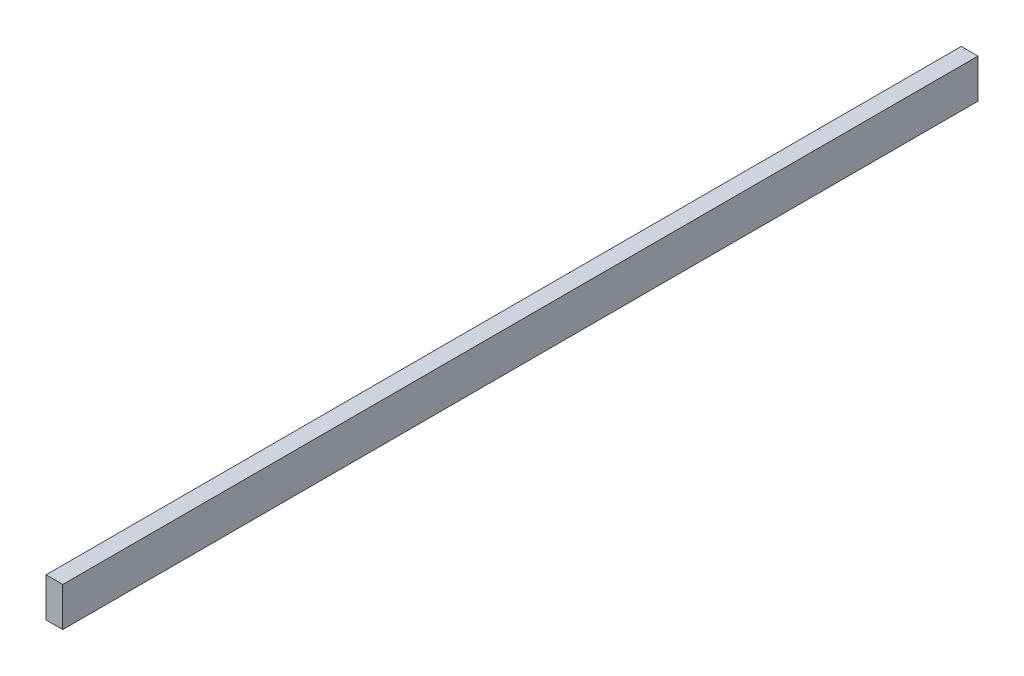
ISO-10303-21;
HEADER;
FILE_DESCRIPTION(('STEP AP214'),'2;1');
FILE_NAME('part.step','',(''),(''),'','','');
FILE_SCHEMA(('AUTOMOTIVE_DESIGN { 1 0 10303 214 1 1 1 1 }'));
ENDSEC;
DATA;
#1=APPLICATION_CONTEXT('core data for automotive mechanical design processes');
#2=APPLICATION_PROTOCOL_DEFINITION('international standard','automotive_design',2000,#1);
#3=PRODUCT_CONTEXT('',#1,'mechanical');
#4=PRODUCT('Part','Part','',(#3));
#5=PRODUCT_RELATED_PRODUCT_CATEGORY('part','',(#4));
#6=PRODUCT_DEFINITION_FORMATION('','',#4);
#7=PRODUCT_DEFINITION_CONTEXT('part definition',#1,'design');
#8=PRODUCT_DEFINITION('design','',#6,#7);
#9=PRODUCT_DEFINITION_SHAPE('','',#8);
#10=(LENGTH_UNIT() NAMED_UNIT(*) SI_UNIT(.MILLI.,.METRE.));
#11=(NAMED_UNIT(*) PLANE_ANGLE_UNIT() SI_UNIT($,.RADIAN.));
#12=(NAMED_UNIT(*) SI_UNIT($,.STERADIAN.) SOLID_ANGLE_UNIT());
#13=UNCERTAINTY_MEASURE_WITH_UNIT(LENGTH_MEASURE(1.E-05),#10,'distance_accuracy_value','');
#14=(GEOMETRIC_REPRESENTATION_CONTEXT(3) GLOBAL_UNCERTAINTY_ASSIGNED_CONTEXT((#13)) GLOBAL_UNIT_ASSIGNED_CONTEXT((#10,
#11,#12)) REPRESENTATION_CONTEXT('',''));
#15=CARTESIAN_POINT('',(0.,0.,0.));
#16=DIRECTION('',(0.,0.,1.));
#17=DIRECTION('',(1.,0.,0.));
#18=AXIS2_PLACEMENT_3D('',#15,#16,#17);
#19=CARTESIAN_POINT('',(38.1,44.45,-1041.4));
#20=DIRECTION('',(0.,0.,1.));
#21=DIRECTION('',(1.,0.,0.));
#22=AXIS2_PLACEMENT_3D('',#19,#20,#21);
#23=PLANE('',#22);
#24=DIRECTION('',(0.,1.,0.));
#25=VECTOR('',#24,1.);
#26=CARTESIAN_POINT('',(0.,44.45,-1041.4));
#27=LINE('',#26,#25);
#28=CARTESIAN_POINT('',(0.,-44.45,-1041.4));
#29=VERTEX_POINT('',#28);
#30=CARTESIAN_POINT('',(0.,44.45,-1041.4));
#31=VERTEX_POINT('',#30);
#32=EDGE_CURVE('E96',#29,#31,#27,.T.);
#33=ORIENTED_EDGE('',*,*,#32,.T.);
#34=DIRECTION('',(-1.,0.,0.));
#35=VECTOR('',#34,1.);
#36=CARTESIAN_POINT('',(38.1,44.45,-1041.4));
#37=LINE('',#36,#35);
#38=CARTESIAN_POINT('',(38.1,44.45,-1041.4));
#39=VERTEX_POINT('',#38);
#40=EDGE_CURVE('E11',#39,#31,#37,.T.);
#41=ORIENTED_EDGE('',*,*,#40,.F.);
#42=DIRECTION('',(0.,1.,0.));
#43=VECTOR('',#42,1.);
#44=CARTESIAN_POINT('',(38.1,44.45,-1041.4));
#45=LINE('',#44,#43);
#46=CARTESIAN_POINT('',(38.1,-44.45,-1041.4));
#47=VERTEX_POINT('',#46);
#48=EDGE_CURVE('E84',#47,#39,#45,.T.);
#49=ORIENTED_EDGE('',*,*,#48,.F.);
#50=DIRECTION('',(-1.,0.,0.));
#51=VECTOR('',#50,1.);
#52=CARTESIAN_POINT('',(38.1,-44.45,-1041.4));
#53=LINE('',#52,#51);
#54=EDGE_CURVE('E92',#47,#29,#53,.T.);
#55=ORIENTED_EDGE('',*,*,#54,.T.);
#56=EDGE_LOOP('',(#33,#41,#49,#55));
#57=FACE_BOUND('',#56,.T.);
#58=ADVANCED_FACE('F33',(#57),#23,.F.);
#59=CARTESIAN_POINT('',(38.1,44.45,1041.4));
#60=DIRECTION('',(0.,-1.,0.));
#61=DIRECTION('',(0.,0.,-1.));
#62=AXIS2_PLACEMENT_3D('',#59,#60,#61);
#63=PLANE('',#62);
#64=DIRECTION('',(0.,0.,1.));
#65=VECTOR('',#64,1.);
#66=CARTESIAN_POINT('',(0.,44.45,1041.4));
#67=LINE('',#66,#65);
#68=CARTESIAN_POINT('',(0.,44.45,1041.4));
#69=VERTEX_POINT('',#68);
#70=EDGE_CURVE('E88',#31,#69,#67,.T.);
#71=ORIENTED_EDGE('',*,*,#70,.T.);
#72=DIRECTION('',(-1.,0.,0.));
#73=VECTOR('',#72,1.);
#74=CARTESIAN_POINT('',(38.1,44.45,1041.4));
#75=LINE('',#74,#73);
#76=CARTESIAN_POINT('',(38.1,44.45,1041.4));
#77=VERTEX_POINT('',#76);
#78=EDGE_CURVE('E41',#77,#69,#75,.T.);
#79=ORIENTED_EDGE('',*,*,#78,.F.);
#80=DIRECTION('',(0.,0.,1.));
#81=VECTOR('',#80,1.);
#82=CARTESIAN_POINT('',(38.1,44.45,1041.4));
#83=LINE('',#82,#81);
#84=EDGE_CURVE('E79',#39,#77,#83,.T.);
#85=ORIENTED_EDGE('',*,*,#84,.F.);
#86=ORIENTED_EDGE('',*,*,#40,.T.);
#87=EDGE_LOOP('',(#71,#79,#85,#86));
#88=FACE_BOUND('',#87,.T.);
#89=ADVANCED_FACE('F87',(#88),#63,.F.);
#90=CARTESIAN_POINT('',(38.1,44.45,1041.4));
#91=DIRECTION('',(0.,0.,-1.));
#92=DIRECTION('',(-1.,0.,0.));
#93=AXIS2_PLACEMENT_3D('',#90,#91,#92);
#94=PLANE('',#93);
#95=DIRECTION('',(0.,-1.,0.));
#96=VECTOR('',#95,1.);
#97=CARTESIAN_POINT('',(0.,44.45,1041.4));
#98=LINE('',#97,#96);
#99=CARTESIAN_POINT('',(0.,-44.45,1041.4));
#100=VERTEX_POINT('',#99);
#101=EDGE_CURVE('E66',#69,#100,#98,.T.);
#102=ORIENTED_EDGE('',*,*,#101,.T.);
#103=DIRECTION('',(-1.,0.,0.));
#104=VECTOR('',#103,1.);
#105=CARTESIAN_POINT('',(38.1,-44.45,1041.4));
#106=LINE('',#105,#104);
#107=CARTESIAN_POINT('',(38.1,-44.45,1041.4));
#108=VERTEX_POINT('',#107);
#109=EDGE_CURVE('E89',#108,#100,#106,.T.);
#110=ORIENTED_EDGE('',*,*,#109,.F.);
#111=DIRECTION('',(0.,-1.,0.));
#112=VECTOR('',#111,1.);
#113=CARTESIAN_POINT('',(38.1,44.45,1041.4));
#114=LINE('',#113,#112);
#115=EDGE_CURVE('E82',#77,#108,#114,.T.);
#116=ORIENTED_EDGE('',*,*,#115,.F.);
#117=ORIENTED_EDGE('',*,*,#78,.T.);
#118=EDGE_LOOP('',(#102,#110,#116,#117));
#119=FACE_BOUND('',#118,.T.);
#120=ADVANCED_FACE('F90',(#119),#94,.F.);
#121=CARTESIAN_POINT('',(38.1,-44.45,1041.4));
#122=DIRECTION('',(0.,1.,0.));
#123=DIRECTION('',(0.,0.,1.));
#124=AXIS2_PLACEMENT_3D('',#121,#122,#123);
#125=PLANE('',#124);
#126=DIRECTION('',(0.,0.,-1.));
#127=VECTOR('',#126,1.);
#128=CARTESIAN_POINT('',(0.,-44.45,1041.4));
#129=LINE('',#128,#127);
#130=EDGE_CURVE('E72',#100,#29,#129,.T.);
#131=ORIENTED_EDGE('',*,*,#130,.T.);
#132=ORIENTED_EDGE('',*,*,#54,.F.);
#133=DIRECTION('',(0.,0.,-1.));
#134=VECTOR('',#133,1.);
#135=CARTESIAN_POINT('',(38.1,-44.45,1041.4));
#136=LINE('',#135,#134);
#137=EDGE_CURVE('E49',#108,#47,#136,.T.);
#138=ORIENTED_EDGE('',*,*,#137,.F.);
#139=ORIENTED_EDGE('',*,*,#109,.T.);
#140=EDGE_LOOP('',(#131,#132,#138,#139));
#141=FACE_BOUND('',#140,.T.);
#142=ADVANCED_FACE('F103',(#141),#125,.F.);
#143=CARTESIAN_POINT('',(38.1,0.,0.));
#144=DIRECTION('',(1.,0.,0.));
#145=DIRECTION('',(0.,0.,-1.));
#146=AXIS2_PLACEMENT_3D('',#143,#144,#145);
#147=PLANE('',#146);
#148=ORIENTED_EDGE('',*,*,#48,.T.);
#149=ORIENTED_EDGE('',*,*,#84,.T.);
#150=ORIENTED_EDGE('',*,*,#115,.T.);
#151=ORIENTED_EDGE('',*,*,#137,.T.);
#152=EDGE_LOOP('',(#148,#149,#150,#151));
#153=FACE_BOUND('',#152,.T.);
#154=ADVANCED_FACE('F80',(#153),#147,.T.);
#155=CARTESIAN_POINT('',(0.,0.,0.));
#156=DIRECTION('',(1.,0.,0.));
#157=DIRECTION('',(0.,0.,-1.));
#158=AXIS2_PLACEMENT_3D('',#155,#156,#157);
#159=PLANE('',#158);
#160=ORIENTED_EDGE('',*,*,#32,.F.);
#161=ORIENTED_EDGE('',*,*,#130,.F.);
#162=ORIENTED_EDGE('',*,*,#101,.F.);
#163=ORIENTED_EDGE('',*,*,#70,.F.);
#164=EDGE_LOOP('',(#160,#161,#162,#163));
#165=FACE_BOUND('',#164,.T.);
#166=ADVANCED_FACE('F106',(#165),#159,.F.);
#167=CLOSED_SHELL('',(#58,#89,#120,#142,#154,#166));
#168=MANIFOLD_SOLID_BREP('B2',#167);
#169=ADVANCED_BREP_SHAPE_REPRESENTATION('',(#18,#168),#14);
#170=SHAPE_DEFINITION_REPRESENTATION(#9,#169);
ENDSEC;
END-ISO-10303-21;
